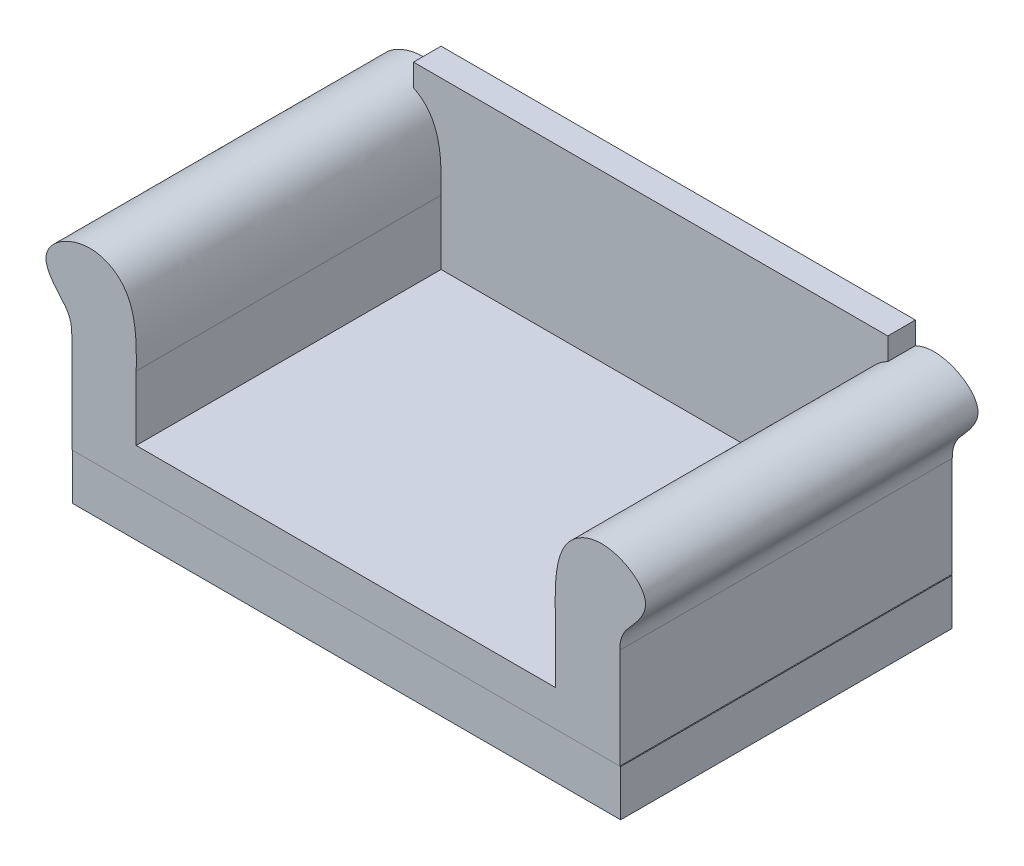
ISO-10303-21;
HEADER;
FILE_DESCRIPTION(('STEP AP214'),'2;1');
FILE_NAME('part.step','',(''),(''),'','','');
FILE_SCHEMA(('AUTOMOTIVE_DESIGN { 1 0 10303 214 1 1 1 1 }'));
ENDSEC;
DATA;
#1=APPLICATION_CONTEXT('core data for automotive mechanical design processes');
#2=APPLICATION_PROTOCOL_DEFINITION('international standard','automotive_design',2000,#1);
#3=PRODUCT_CONTEXT('',#1,'mechanical');
#4=PRODUCT('Part','Part','',(#3));
#5=PRODUCT_RELATED_PRODUCT_CATEGORY('part','',(#4));
#6=PRODUCT_DEFINITION_FORMATION('','',#4);
#7=PRODUCT_DEFINITION_CONTEXT('part definition',#1,'design');
#8=PRODUCT_DEFINITION('design','',#6,#7);
#9=PRODUCT_DEFINITION_SHAPE('','',#8);
#10=(LENGTH_UNIT() NAMED_UNIT(*) SI_UNIT(.MILLI.,.METRE.));
#11=(NAMED_UNIT(*) PLANE_ANGLE_UNIT() SI_UNIT($,.RADIAN.));
#12=(NAMED_UNIT(*) SI_UNIT($,.STERADIAN.) SOLID_ANGLE_UNIT());
#13=UNCERTAINTY_MEASURE_WITH_UNIT(LENGTH_MEASURE(1.E-05),#10,'distance_accuracy_value','');
#14=(GEOMETRIC_REPRESENTATION_CONTEXT(3) GLOBAL_UNCERTAINTY_ASSIGNED_CONTEXT((#13)) GLOBAL_UNIT_ASSIGNED_CONTEXT((#10,
#11,#12)) REPRESENTATION_CONTEXT('',''));
#15=CARTESIAN_POINT('',(0.,0.,0.));
#16=DIRECTION('',(0.,0.,1.));
#17=DIRECTION('',(1.,0.,0.));
#18=AXIS2_PLACEMENT_3D('',#15,#16,#17);
#19=CARTESIAN_POINT('',(755.650000000029,406.4,-2188.44072928543));
#20=CARTESIAN_POINT('',(755.650000000029,451.087278401494,-2188.44072928543));
#21=CARTESIAN_POINT('',(791.216850954464,477.433435735854,-2188.44072928543));
#22=CARTESIAN_POINT('',(855.398910121323,573.852472449306,-2188.44072928543));
#23=CARTESIAN_POINT('',(720.303655557243,663.232501148757,-2188.44072928543));
#24=CARTESIAN_POINT('',(568.867733776214,589.838855635776,-2188.44072928543));
#25=CARTESIAN_POINT('',(577.850000000043,447.650661262856,-2188.44072928543));
#26=CARTESIAN_POINT('',(577.850000000043,406.4,-2188.44072928543));
#27=B_SPLINE_CURVE_WITH_KNOTS('',3,(#19,#20,#21,#22,#23,#24,#25,#26),.UNSPECIFIED.,.F.,.F.,(4,1,
1,1,1,4),(0.,0.157242682819164,0.266642819215483,0.492649096613345,0.701571925078321,1.),.UNSPECIFIED.);
#28=DIRECTION('',(0.,0.,1.));
#29=VECTOR('',#28,1.);
#30=SURFACE_OF_LINEAR_EXTRUSION('',#27,#29);
#31=DIRECTION('',(0.,0.,1.));
#32=VECTOR('',#31,1.);
#33=CARTESIAN_POINT('',(654.05,624.464719554952,1.27000000001143));
#34=LINE('',#33,#32);
#35=CARTESIAN_POINT('',(654.05,624.464719554952,-381.));
#36=VERTEX_POINT('',#35);
#37=CARTESIAN_POINT('',(654.05,624.464719554952,-457.2));
#38=VERTEX_POINT('',#37);
#39=EDGE_CURVE('E12',#36,#38,#34,.F.);
#40=ORIENTED_EDGE('',*,*,#39,.F.);
#41=CARTESIAN_POINT('',(755.650000000029,406.4,-381.));
#42=CARTESIAN_POINT('',(755.650000000029,451.087278401494,-381.));
#43=CARTESIAN_POINT('',(791.216850954464,477.433435735854,-381.));
#44=CARTESIAN_POINT('',(855.398910121323,573.852472449306,-381.));
#45=CARTESIAN_POINT('',(720.303655557243,663.232501148757,-381.));
#46=CARTESIAN_POINT('',(568.867733776214,589.838855635776,-381.));
#47=CARTESIAN_POINT('',(577.850000000043,447.650661262856,-381.));
#48=CARTESIAN_POINT('',(577.850000000043,406.4,-381.));
#49=B_SPLINE_CURVE_WITH_KNOTS('',3,(#41,#42,#43,#44,#45,#46,#47,#48),.UNSPECIFIED.,.F.,.F.,(4,1,
1,1,1,4),(0.,0.157242682819164,0.266642819215483,0.492649096613345,0.701571925078321,1.),.UNSPECIFIED.);
#50=CARTESIAN_POINT('',(577.850000000029,406.4,-381.));
#51=VERTEX_POINT('',#50);
#52=EDGE_CURVE('E137',#36,#51,#49,.T.);
#53=ORIENTED_EDGE('',*,*,#52,.T.);
#54=DIRECTION('',(0.,0.,1.));
#55=VECTOR('',#54,1.);
#56=CARTESIAN_POINT('',(577.850000000029,406.4,-2188.44072928543));
#57=LINE('',#56,#55);
#58=CARTESIAN_POINT('',(577.850000000029,406.4,459.739999999976));
#59=VERTEX_POINT('',#58);
#60=EDGE_CURVE('E148',#51,#59,#57,.T.);
#61=ORIENTED_EDGE('',*,*,#60,.T.);
#62=CARTESIAN_POINT('',(755.650000000029,406.4,459.739999999976));
#63=CARTESIAN_POINT('',(755.650000000029,451.087278401494,459.739999999976));
#64=CARTESIAN_POINT('',(791.216850954464,477.433435735854,459.739999999976));
#65=CARTESIAN_POINT('',(855.398910121323,573.852472449306,459.739999999976));
#66=CARTESIAN_POINT('',(720.303655557243,663.232501148757,459.739999999976));
#67=CARTESIAN_POINT('',(568.867733776214,589.838855635776,459.739999999976));
#68=CARTESIAN_POINT('',(577.850000000043,447.650661262856,459.739999999976));
#69=CARTESIAN_POINT('',(577.850000000043,406.4,459.739999999976));
#70=B_SPLINE_CURVE_WITH_KNOTS('',3,(#62,#63,#64,#65,#66,#67,#68,#69),.UNSPECIFIED.,.F.,.F.,(4,1,
1,1,1,4),(0.,0.157242682819164,0.266642819215483,0.492649096613345,0.701571925078321,1.),.UNSPECIFIED.);
#71=CARTESIAN_POINT('',(755.650000000029,406.4,459.739999999976));
#72=VERTEX_POINT('',#71);
#73=EDGE_CURVE('E128',#72,#59,#70,.T.);
#74=ORIENTED_EDGE('',*,*,#73,.F.);
#75=DIRECTION('',(0.,0.,1.));
#76=VECTOR('',#75,1.);
#77=CARTESIAN_POINT('',(755.650000000029,406.4,-2188.44072928543));
#78=LINE('',#77,#76);
#79=CARTESIAN_POINT('',(755.650000000014,406.4,-457.199999999953));
#80=VERTEX_POINT('',#79);
#81=EDGE_CURVE('E113',#80,#72,#78,.T.);
#82=ORIENTED_EDGE('',*,*,#81,.F.);
#83=CARTESIAN_POINT('',(755.650000000029,406.4,-457.199999999976));
#84=CARTESIAN_POINT('',(755.650000000029,451.087278401494,-457.199999999976));
#85=CARTESIAN_POINT('',(791.216850954464,477.433435735854,-457.199999999976));
#86=CARTESIAN_POINT('',(855.398910121323,573.852472449306,-457.199999999976));
#87=CARTESIAN_POINT('',(720.303655557243,663.232501148757,-457.199999999976));
#88=CARTESIAN_POINT('',(568.867733776214,589.838855635776,-457.199999999976));
#89=CARTESIAN_POINT('',(577.850000000043,447.650661262856,-457.199999999976));
#90=CARTESIAN_POINT('',(577.850000000043,406.4,-457.199999999976));
#91=B_SPLINE_CURVE_WITH_KNOTS('',3,(#83,#84,#85,#86,#87,#88,#89,#90),.UNSPECIFIED.,.F.,.F.,(4,1,
1,1,1,4),(0.,0.157242682819164,0.266642819215483,0.492649096613345,0.701571925078321,1.),.UNSPECIFIED.);
#92=EDGE_CURVE('E104',#80,#38,#91,.T.);
#93=ORIENTED_EDGE('',*,*,#92,.T.);
#94=EDGE_LOOP('',(#40,#53,#61,#74,#82,#93));
#95=FACE_BOUND('',#94,.T.);
#96=ADVANCED_FACE('F53',(#95),#30,.T.);
#97=CARTESIAN_POINT('',(577.850000000029,406.4,-2188.44072928543));
#98=DIRECTION('',(-1.,0.,0.));
#99=DIRECTION('',(0.,0.,1.));
#100=AXIS2_PLACEMENT_3D('',#97,#98,#99);
#101=PLANE('',#100);
#102=ORIENTED_EDGE('',*,*,#60,.F.);
#103=DIRECTION('',(0.,-1.,0.));
#104=VECTOR('',#103,1.);
#105=CARTESIAN_POINT('',(577.850000000029,406.4,-381.));
#106=LINE('',#105,#104);
#107=CARTESIAN_POINT('',(577.850000000029,228.6,-381.));
#108=VERTEX_POINT('',#107);
#109=EDGE_CURVE('E259',#51,#108,#106,.T.);
#110=ORIENTED_EDGE('',*,*,#109,.T.);
#111=DIRECTION('',(0.,0.,1.));
#112=VECTOR('',#111,1.);
#113=CARTESIAN_POINT('',(577.850000000029,228.6,-2188.44072928543));
#114=LINE('',#113,#112);
#115=CARTESIAN_POINT('',(577.850000000029,228.6,459.739999999976));
#116=VERTEX_POINT('',#115);
#117=EDGE_CURVE('E162',#108,#116,#114,.T.);
#118=ORIENTED_EDGE('',*,*,#117,.T.);
#119=DIRECTION('',(0.,-1.,0.));
#120=VECTOR('',#119,1.);
#121=CARTESIAN_POINT('',(577.850000000029,406.4,459.739999999976));
#122=LINE('',#121,#120);
#123=EDGE_CURVE('E125',#59,#116,#122,.T.);
#124=ORIENTED_EDGE('',*,*,#123,.F.);
#125=EDGE_LOOP('',(#102,#110,#118,#124));
#126=FACE_BOUND('',#125,.T.);
#127=ADVANCED_FACE('F193',(#126),#101,.T.);
#128=CARTESIAN_POINT('',(-577.85,228.6,-2188.44072928543));
#129=DIRECTION('',(0.,-1.,0.));
#130=DIRECTION('',(0.,0.,-1.));
#131=AXIS2_PLACEMENT_3D('',#128,#129,#130);
#132=PLANE('',#131);
#133=DIRECTION('',(1.,0.,0.));
#134=VECTOR('',#133,1.);
#135=CARTESIAN_POINT('',(-654.05,228.6,-381.));
#136=LINE('',#135,#134);
#137=CARTESIAN_POINT('',(-577.85,228.6,-381.));
#138=VERTEX_POINT('',#137);
#139=EDGE_CURVE('E246',#138,#108,#136,.T.);
#140=ORIENTED_EDGE('',*,*,#139,.F.);
#141=DIRECTION('',(0.,0.,1.));
#142=VECTOR('',#141,1.);
#143=CARTESIAN_POINT('',(-577.85,228.6,-2188.44072928543));
#144=LINE('',#143,#142);
#145=CARTESIAN_POINT('',(-577.85,228.6,459.739999999976));
#146=VERTEX_POINT('',#145);
#147=EDGE_CURVE('E160',#138,#146,#144,.T.);
#148=ORIENTED_EDGE('',*,*,#147,.T.);
#149=DIRECTION('',(1.,0.,0.));
#150=VECTOR('',#149,1.);
#151=CARTESIAN_POINT('',(-577.85,228.6,459.739999999976));
#152=LINE('',#151,#150);
#153=EDGE_CURVE('E159',#146,#116,#152,.T.);
#154=ORIENTED_EDGE('',*,*,#153,.T.);
#155=ORIENTED_EDGE('',*,*,#117,.F.);
#156=EDGE_LOOP('',(#140,#148,#154,#155));
#157=FACE_BOUND('',#156,.T.);
#158=ADVANCED_FACE('F189',(#157),#132,.F.);
#159=CARTESIAN_POINT('',(-577.85,406.4,-2188.44072928543));
#160=DIRECTION('',(-1.,0.,0.));
#161=DIRECTION('',(0.,0.,1.));
#162=AXIS2_PLACEMENT_3D('',#159,#160,#161);
#163=PLANE('',#162);
#164=DIRECTION('',(0.,-1.,0.));
#165=VECTOR('',#164,1.);
#166=CARTESIAN_POINT('',(-577.85,406.4,-381.));
#167=LINE('',#166,#165);
#168=CARTESIAN_POINT('',(-577.850000000014,406.4,-381.));
#169=VERTEX_POINT('',#168);
#170=EDGE_CURVE('E255',#169,#138,#167,.T.);
#171=ORIENTED_EDGE('',*,*,#170,.F.);
#172=DIRECTION('',(0.,0.,1.));
#173=VECTOR('',#172,1.);
#174=CARTESIAN_POINT('',(-577.850000000014,406.4,-2188.44072928543));
#175=LINE('',#174,#173);
#176=CARTESIAN_POINT('',(-577.850000000014,406.4,459.739999999976));
#177=VERTEX_POINT('',#176);
#178=EDGE_CURVE('E157',#169,#177,#175,.T.);
#179=ORIENTED_EDGE('',*,*,#178,.T.);
#180=DIRECTION('',(0.,-1.,0.));
#181=VECTOR('',#180,1.);
#182=CARTESIAN_POINT('',(-577.85,406.4,459.739999999976));
#183=LINE('',#182,#181);
#184=EDGE_CURVE('E156',#177,#146,#183,.T.);
#185=ORIENTED_EDGE('',*,*,#184,.T.);
#186=ORIENTED_EDGE('',*,*,#147,.F.);
#187=EDGE_LOOP('',(#171,#179,#185,#186));
#188=FACE_BOUND('',#187,.T.);
#189=ADVANCED_FACE('F183',(#188),#163,.F.);
#190=CARTESIAN_POINT('',(-755.65,406.4,-2188.44072928543));
#191=CARTESIAN_POINT('',(-755.65,451.087278401494,-2188.44072928543));
#192=CARTESIAN_POINT('',(-791.216850954435,477.433435735854,-2188.44072928543));
#193=CARTESIAN_POINT('',(-855.398910121294,573.852472449306,-2188.44072928543));
#194=CARTESIAN_POINT('',(-720.303655557214,663.232501148757,-2188.44072928543));
#195=CARTESIAN_POINT('',(-568.867733776185,589.838855635776,-2188.44072928543));
#196=CARTESIAN_POINT('',(-577.850000000014,447.650661262856,-2188.44072928543));
#197=CARTESIAN_POINT('',(-577.850000000014,406.4,-2188.44072928543));
#198=B_SPLINE_CURVE_WITH_KNOTS('',3,(#190,#191,#192,#193,#194,#195,#196,#197),.UNSPECIFIED.,.F.,
.F.,(4,1,1,1,1,4),(0.,0.157242682819164,0.266642819215483,0.492649096613345,0.701571925078321,
1.),.UNSPECIFIED.);
#199=DIRECTION('',(0.,0.,1.));
#200=VECTOR('',#199,1.);
#201=SURFACE_OF_LINEAR_EXTRUSION('',#198,#200);
#202=DIRECTION('',(0.,0.,1.));
#203=VECTOR('',#202,1.);
#204=CARTESIAN_POINT('',(-654.049999999999,624.464719554965,1.269999999991));
#205=LINE('',#204,#203);
#206=CARTESIAN_POINT('',(-654.05,624.464719554966,-457.2));
#207=VERTEX_POINT('',#206);
#208=CARTESIAN_POINT('',(-654.05,624.464719554966,-381.));
#209=VERTEX_POINT('',#208);
#210=EDGE_CURVE('E62',#207,#209,#205,.T.);
#211=ORIENTED_EDGE('',*,*,#210,.F.);
#212=CARTESIAN_POINT('',(-755.65,406.4,-457.199999999976));
#213=CARTESIAN_POINT('',(-755.65,451.087278401494,-457.199999999976));
#214=CARTESIAN_POINT('',(-791.216850954435,477.433435735854,-457.199999999976));
#215=CARTESIAN_POINT('',(-855.398910121294,573.852472449306,-457.199999999976));
#216=CARTESIAN_POINT('',(-720.303655557214,663.232501148757,-457.199999999976));
#217=CARTESIAN_POINT('',(-568.867733776185,589.838855635776,-457.199999999976));
#218=CARTESIAN_POINT('',(-577.850000000014,447.650661262856,-457.199999999976));
#219=CARTESIAN_POINT('',(-577.850000000014,406.4,-457.199999999976));
#220=B_SPLINE_CURVE_WITH_KNOTS('',3,(#212,#213,#214,#215,#216,#217,#218,#219),.UNSPECIFIED.,.F.,
.F.,(4,1,1,1,1,4),(0.,0.157242682819164,0.266642819215483,0.492649096613345,0.701571925078321,
1.),.UNSPECIFIED.);
#221=CARTESIAN_POINT('',(-755.65,406.4,-457.199999999976));
#222=VERTEX_POINT('',#221);
#223=EDGE_CURVE('E136',#222,#207,#220,.T.);
#224=ORIENTED_EDGE('',*,*,#223,.F.);
#225=DIRECTION('',(0.,0.,1.));
#226=VECTOR('',#225,1.);
#227=CARTESIAN_POINT('',(-755.65,406.4,-2188.44072928543));
#228=LINE('',#227,#226);
#229=CARTESIAN_POINT('',(-755.65,406.4,459.739999999976));
#230=VERTEX_POINT('',#229);
#231=EDGE_CURVE('E153',#222,#230,#228,.T.);
#232=ORIENTED_EDGE('',*,*,#231,.T.);
#233=CARTESIAN_POINT('',(-755.65,406.4,459.739999999976));
#234=CARTESIAN_POINT('',(-755.65,451.087278401494,459.739999999976));
#235=CARTESIAN_POINT('',(-791.216850954435,477.433435735854,459.739999999976));
#236=CARTESIAN_POINT('',(-855.398910121294,573.852472449306,459.739999999976));
#237=CARTESIAN_POINT('',(-720.303655557214,663.232501148757,459.739999999976));
#238=CARTESIAN_POINT('',(-568.867733776185,589.838855635776,459.739999999976));
#239=CARTESIAN_POINT('',(-577.850000000014,447.650661262856,459.739999999976));
#240=CARTESIAN_POINT('',(-577.850000000014,406.4,459.739999999976));
#241=B_SPLINE_CURVE_WITH_KNOTS('',3,(#233,#234,#235,#236,#237,#238,#239,#240),.UNSPECIFIED.,.F.,
.F.,(4,1,1,1,1,4),(0.,0.157242682819164,0.266642819215483,0.492649096613345,0.701571925078321,
1.),.UNSPECIFIED.);
#242=EDGE_CURVE('E155',#230,#177,#241,.T.);
#243=ORIENTED_EDGE('',*,*,#242,.T.);
#244=ORIENTED_EDGE('',*,*,#178,.F.);
#245=CARTESIAN_POINT('',(-755.65,406.4,-381.));
#246=CARTESIAN_POINT('',(-755.65,451.087278401494,-381.));
#247=CARTESIAN_POINT('',(-791.216850954435,477.433435735854,-381.));
#248=CARTESIAN_POINT('',(-855.398910121294,573.852472449306,-381.));
#249=CARTESIAN_POINT('',(-720.303655557214,663.232501148757,-381.));
#250=CARTESIAN_POINT('',(-568.867733776185,589.838855635776,-381.));
#251=CARTESIAN_POINT('',(-577.850000000014,447.650661262856,-381.));
#252=CARTESIAN_POINT('',(-577.850000000014,406.4,-381.));
#253=B_SPLINE_CURVE_WITH_KNOTS('',3,(#245,#246,#247,#248,#249,#250,#251,#252),.UNSPECIFIED.,.F.,
.F.,(4,1,1,1,1,4),(0.,0.157242682819164,0.266642819215483,0.492649096613345,0.701571925078321,
1.),.UNSPECIFIED.);
#254=EDGE_CURVE('E310',#209,#169,#253,.T.);
#255=ORIENTED_EDGE('',*,*,#254,.F.);
#256=EDGE_LOOP('',(#211,#224,#232,#243,#244,#255));
#257=FACE_BOUND('',#256,.T.);
#258=ADVANCED_FACE('F179',(#257),#201,.F.);
#259=CARTESIAN_POINT('',(1.42742960308941E-11,127.,-457.199999999976));
#260=DIRECTION('',(0.,0.,-1.));
#261=DIRECTION('',(-1.,0.,0.));
#262=AXIS2_PLACEMENT_3D('',#259,#260,#261);
#263=PLANE('',#262);
#264=DIRECTION('',(0.,-1.,0.));
#265=VECTOR('',#264,1.);
#266=CARTESIAN_POINT('',(654.05,685.8,-457.2));
#267=LINE('',#266,#265);
#268=CARTESIAN_POINT('',(654.05,685.8,-457.2));
#269=VERTEX_POINT('',#268);
#270=EDGE_CURVE('E262',#269,#38,#267,.T.);
#271=ORIENTED_EDGE('',*,*,#270,.T.);
#272=ORIENTED_EDGE('',*,*,#92,.F.);
#273=DIRECTION('',(0.,1.,0.));
#274=VECTOR('',#273,1.);
#275=CARTESIAN_POINT('',(755.650000000014,129.54,-457.199999999953));
#276=LINE('',#275,#274);
#277=CARTESIAN_POINT('',(755.650000000014,129.54,-457.199999999976));
#278=VERTEX_POINT('',#277);
#279=EDGE_CURVE('E108',#278,#80,#276,.T.);
#280=ORIENTED_EDGE('',*,*,#279,.F.);
#281=DIRECTION('',(1.,0.,0.));
#282=VECTOR('',#281,1.);
#283=CARTESIAN_POINT('',(-755.650000000039,129.54,-457.2));
#284=LINE('',#283,#282);
#285=CARTESIAN_POINT('',(-755.649999999986,129.54,-457.2));
#286=VERTEX_POINT('',#285);
#287=EDGE_CURVE('E111',#286,#278,#284,.T.);
#288=ORIENTED_EDGE('',*,*,#287,.F.);
#289=DIRECTION('',(0.,1.,0.));
#290=VECTOR('',#289,1.);
#291=CARTESIAN_POINT('',(-755.649999999986,129.54,-457.2));
#292=LINE('',#291,#290);
#293=EDGE_CURVE('E134',#286,#222,#292,.T.);
#294=ORIENTED_EDGE('',*,*,#293,.T.);
#295=ORIENTED_EDGE('',*,*,#223,.T.);
#296=DIRECTION('',(0.,-1.,0.));
#297=VECTOR('',#296,1.);
#298=CARTESIAN_POINT('',(-654.05,685.8,-457.2));
#299=LINE('',#298,#297);
#300=CARTESIAN_POINT('',(-654.05,685.8,-457.2));
#301=VERTEX_POINT('',#300);
#302=EDGE_CURVE('E318',#301,#207,#299,.T.);
#303=ORIENTED_EDGE('',*,*,#302,.F.);
#304=DIRECTION('',(1.,0.,0.));
#305=VECTOR('',#304,1.);
#306=CARTESIAN_POINT('',(-654.05,685.8,-457.2));
#307=LINE('',#306,#305);
#308=EDGE_CURVE('E243',#301,#269,#307,.T.);
#309=ORIENTED_EDGE('',*,*,#308,.T.);
#310=EDGE_LOOP('',(#271,#272,#280,#288,#294,#295,#303,#309));
#311=FACE_BOUND('',#310,.T.);
#312=ADVANCED_FACE('F55',(#311),#263,.T.);
#313=CARTESIAN_POINT('',(-715.980650784061,635.494561155671,459.739999999976));
#314=DIRECTION('',(0.,0.,-1.));
#315=DIRECTION('',(-1.,0.,0.));
#316=AXIS2_PLACEMENT_3D('',#313,#314,#315);
#317=PLANE('',#316);
#318=DIRECTION('',(0.,1.,0.));
#319=VECTOR('',#318,1.);
#320=CARTESIAN_POINT('',(-755.649999999986,129.54,459.739999999976));
#321=LINE('',#320,#319);
#322=CARTESIAN_POINT('',(-755.649999999986,129.54,459.739999999976));
#323=VERTEX_POINT('',#322);
#324=EDGE_CURVE('E132',#323,#230,#321,.T.);
#325=ORIENTED_EDGE('',*,*,#324,.F.);
#326=DIRECTION('',(1.,0.,0.));
#327=VECTOR('',#326,1.);
#328=CARTESIAN_POINT('',(-755.649999999986,129.54,459.739999999976));
#329=LINE('',#328,#327);
#330=CARTESIAN_POINT('',(755.650000000014,129.54,459.739999999976));
#331=VERTEX_POINT('',#330);
#332=EDGE_CURVE('E142',#323,#331,#329,.T.);
#333=ORIENTED_EDGE('',*,*,#332,.T.);
#334=DIRECTION('',(0.,1.,0.));
#335=VECTOR('',#334,1.);
#336=CARTESIAN_POINT('',(755.650000000014,129.54,459.739999999976));
#337=LINE('',#336,#335);
#338=EDGE_CURVE('E119',#331,#72,#337,.T.);
#339=ORIENTED_EDGE('',*,*,#338,.T.);
#340=ORIENTED_EDGE('',*,*,#73,.T.);
#341=ORIENTED_EDGE('',*,*,#123,.T.);
#342=ORIENTED_EDGE('',*,*,#153,.F.);
#343=ORIENTED_EDGE('',*,*,#184,.F.);
#344=ORIENTED_EDGE('',*,*,#242,.F.);
#345=EDGE_LOOP('',(#325,#333,#339,#340,#341,#342,#343,#344));
#346=FACE_BOUND('',#345,.T.);
#347=ADVANCED_FACE('F203',(#346),#317,.F.);
#348=CARTESIAN_POINT('',(-755.649999999986,129.54,-2188.44072928543));
#349=DIRECTION('',(0.,-1.,0.));
#350=DIRECTION('',(0.,0.,-1.));
#351=AXIS2_PLACEMENT_3D('',#348,#349,#350);
#352=PLANE('',#351);
#353=DIRECTION('',(0.,0.,1.));
#354=VECTOR('',#353,1.);
#355=CARTESIAN_POINT('',(-755.649999999986,129.54,-2188.44072928543));
#356=LINE('',#355,#354);
#357=EDGE_CURVE('E70',#286,#323,#356,.T.);
#358=ORIENTED_EDGE('',*,*,#357,.F.);
#359=ORIENTED_EDGE('',*,*,#287,.T.);
#360=DIRECTION('',(0.,0.,1.));
#361=VECTOR('',#360,1.);
#362=CARTESIAN_POINT('',(755.650000000014,129.54,-2188.44072928543));
#363=LINE('',#362,#361);
#364=EDGE_CURVE('E114',#278,#331,#363,.T.);
#365=ORIENTED_EDGE('',*,*,#364,.T.);
#366=ORIENTED_EDGE('',*,*,#332,.F.);
#367=EDGE_LOOP('',(#358,#359,#365,#366));
#368=FACE_BOUND('',#367,.T.);
#369=ADVANCED_FACE('F124',(#368),#352,.T.);
#370=CARTESIAN_POINT('',(755.650000000014,129.54,-2188.44072928543));
#371=DIRECTION('',(1.,0.,0.));
#372=DIRECTION('',(0.,0.,-1.));
#373=AXIS2_PLACEMENT_3D('',#370,#371,#372);
#374=PLANE('',#373);
#375=ORIENTED_EDGE('',*,*,#364,.F.);
#376=ORIENTED_EDGE('',*,*,#279,.T.);
#377=ORIENTED_EDGE('',*,*,#81,.T.);
#378=ORIENTED_EDGE('',*,*,#338,.F.);
#379=EDGE_LOOP('',(#375,#376,#377,#378));
#380=FACE_BOUND('',#379,.T.);
#381=ADVANCED_FACE('F117',(#380),#374,.T.);
#382=CARTESIAN_POINT('',(-755.649999999986,129.54,-2188.44072928543));
#383=DIRECTION('',(1.,0.,0.));
#384=DIRECTION('',(0.,0.,-1.));
#385=AXIS2_PLACEMENT_3D('',#382,#383,#384);
#386=PLANE('',#385);
#387=ORIENTED_EDGE('',*,*,#293,.F.);
#388=ORIENTED_EDGE('',*,*,#357,.T.);
#389=ORIENTED_EDGE('',*,*,#324,.T.);
#390=ORIENTED_EDGE('',*,*,#231,.F.);
#391=EDGE_LOOP('',(#387,#388,#389,#390));
#392=FACE_BOUND('',#391,.T.);
#393=ADVANCED_FACE('F185',(#392),#386,.F.);
#394=CARTESIAN_POINT('',(-654.05,685.8,-457.2));
#395=DIRECTION('',(1.,0.,0.));
#396=DIRECTION('',(0.,0.,-1.));
#397=AXIS2_PLACEMENT_3D('',#394,#395,#396);
#398=PLANE('',#397);
#399=ORIENTED_EDGE('',*,*,#302,.T.);
#400=ORIENTED_EDGE('',*,*,#210,.T.);
#401=DIRECTION('',(0.,-1.,0.));
#402=VECTOR('',#401,1.);
#403=CARTESIAN_POINT('',(-654.05,685.8,-381.));
#404=LINE('',#403,#402);
#405=CARTESIAN_POINT('',(-654.05,685.8,-381.));
#406=VERTEX_POINT('',#405);
#407=EDGE_CURVE('E250',#406,#209,#404,.T.);
#408=ORIENTED_EDGE('',*,*,#407,.F.);
#409=DIRECTION('',(0.,0.,1.));
#410=VECTOR('',#409,1.);
#411=CARTESIAN_POINT('',(-654.05,685.8,-457.2));
#412=LINE('',#411,#410);
#413=EDGE_CURVE('E234',#301,#406,#412,.T.);
#414=ORIENTED_EDGE('',*,*,#413,.F.);
#415=EDGE_LOOP('',(#399,#400,#408,#414));
#416=FACE_BOUND('',#415,.T.);
#417=ADVANCED_FACE('F212',(#416),#398,.F.);
#418=CARTESIAN_POINT('',(-654.05,685.8,-381.));
#419=DIRECTION('',(0.,0.,-1.));
#420=DIRECTION('',(-1.,0.,0.));
#421=AXIS2_PLACEMENT_3D('',#418,#419,#420);
#422=PLANE('',#421);
#423=ORIENTED_EDGE('',*,*,#52,.F.);
#424=DIRECTION('',(0.,-1.,0.));
#425=VECTOR('',#424,1.);
#426=CARTESIAN_POINT('',(654.05,685.8,-381.));
#427=LINE('',#426,#425);
#428=CARTESIAN_POINT('',(654.05,685.8,-381.));
#429=VERTEX_POINT('',#428);
#430=EDGE_CURVE('E256',#429,#36,#427,.T.);
#431=ORIENTED_EDGE('',*,*,#430,.F.);
#432=DIRECTION('',(1.,0.,0.));
#433=VECTOR('',#432,1.);
#434=CARTESIAN_POINT('',(-654.05,685.8,-381.));
#435=LINE('',#434,#433);
#436=EDGE_CURVE('E239',#406,#429,#435,.T.);
#437=ORIENTED_EDGE('',*,*,#436,.F.);
#438=ORIENTED_EDGE('',*,*,#407,.T.);
#439=ORIENTED_EDGE('',*,*,#254,.T.);
#440=ORIENTED_EDGE('',*,*,#170,.T.);
#441=ORIENTED_EDGE('',*,*,#139,.T.);
#442=ORIENTED_EDGE('',*,*,#109,.F.);
#443=EDGE_LOOP('',(#423,#431,#437,#438,#439,#440,#441,#442));
#444=FACE_BOUND('',#443,.T.);
#445=ADVANCED_FACE('F215',(#444),#422,.F.);
#446=CARTESIAN_POINT('',(654.05,685.8,-457.2));
#447=DIRECTION('',(1.,0.,0.));
#448=DIRECTION('',(0.,0.,-1.));
#449=AXIS2_PLACEMENT_3D('',#446,#447,#448);
#450=PLANE('',#449);
#451=ORIENTED_EDGE('',*,*,#430,.T.);
#452=ORIENTED_EDGE('',*,*,#39,.T.);
#453=ORIENTED_EDGE('',*,*,#270,.F.);
#454=DIRECTION('',(0.,0.,1.));
#455=VECTOR('',#454,1.);
#456=CARTESIAN_POINT('',(654.05,685.8,-457.2));
#457=LINE('',#456,#455);
#458=EDGE_CURVE('E341',#269,#429,#457,.T.);
#459=ORIENTED_EDGE('',*,*,#458,.T.);
#460=EDGE_LOOP('',(#451,#452,#453,#459));
#461=FACE_BOUND('',#460,.T.);
#462=ADVANCED_FACE('F219',(#461),#450,.T.);
#463=CARTESIAN_POINT('',(0.,685.8,0.));
#464=DIRECTION('',(0.,1.,0.));
#465=DIRECTION('',(0.,0.,1.));
#466=AXIS2_PLACEMENT_3D('',#463,#464,#465);
#467=PLANE('',#466);
#468=ORIENTED_EDGE('',*,*,#413,.T.);
#469=ORIENTED_EDGE('',*,*,#436,.T.);
#470=ORIENTED_EDGE('',*,*,#458,.F.);
#471=ORIENTED_EDGE('',*,*,#308,.F.);
#472=EDGE_LOOP('',(#468,#469,#470,#471));
#473=FACE_BOUND('',#472,.T.);
#474=ADVANCED_FACE('F223',(#473),#467,.T.);
#475=CLOSED_SHELL('',(#96,#127,#158,#189,#258,#312,#347,#369,#381,#393,#417,#445,#462,#474));
#476=MANIFOLD_SOLID_BREP('B2',#475);
#477=CARTESIAN_POINT('',(-666.75,127.,0.));
#478=DIRECTION('',(1.,0.,0.));
#479=DIRECTION('',(0.,0.,-1.));
#480=AXIS2_PLACEMENT_3D('',#477,#478,#479);
#481=PLANE('',#480);
#482=DIRECTION('',(0.,0.,1.));
#483=VECTOR('',#482,1.);
#484=CARTESIAN_POINT('',(-666.75,0.,0.));
#485=LINE('',#484,#483);
#486=CARTESIAN_POINT('',(-666.75,0.,-431.800000000003));
#487=VERTEX_POINT('',#486);
#488=CARTESIAN_POINT('',(-666.75,0.,431.800000000003));
#489=VERTEX_POINT('',#488);
#490=EDGE_CURVE('E604',#487,#489,#485,.T.);
#491=ORIENTED_EDGE('',*,*,#490,.F.);
#492=DIRECTION('',(0.,-1.,0.));
#493=VECTOR('',#492,1.);
#494=CARTESIAN_POINT('',(-666.75,127.,-431.800000000003));
#495=LINE('',#494,#493);
#496=CARTESIAN_POINT('',(-666.75,127.,-431.800000000003));
#497=VERTEX_POINT('',#496);
#498=EDGE_CURVE('E51',#497,#487,#495,.T.);
#499=ORIENTED_EDGE('',*,*,#498,.F.);
#500=DIRECTION('',(0.,0.,1.));
#501=VECTOR('',#500,1.);
#502=CARTESIAN_POINT('',(-666.75,127.,0.));
#503=LINE('',#502,#501);
#504=CARTESIAN_POINT('',(-666.75,127.,431.800000000003));
#505=VERTEX_POINT('',#504);
#506=EDGE_CURVE('E541',#497,#505,#503,.T.);
#507=ORIENTED_EDGE('',*,*,#506,.T.);
#508=DIRECTION('',(0.,-1.,0.));
#509=VECTOR('',#508,1.);
#510=CARTESIAN_POINT('',(-666.75,127.,431.800000000003));
#511=LINE('',#510,#509);
#512=EDGE_CURVE('E451',#505,#489,#511,.T.);
#513=ORIENTED_EDGE('',*,*,#512,.T.);
#514=EDGE_LOOP('',(#491,#499,#507,#513));
#515=FACE_BOUND('',#514,.T.);
#516=ADVANCED_FACE('F432',(#515),#481,.T.);
#517=CARTESIAN_POINT('',(0.,127.,-431.800000000003));
#518=DIRECTION('',(0.,0.,-1.));
#519=DIRECTION('',(-1.,0.,0.));
#520=AXIS2_PLACEMENT_3D('',#517,#518,#519);
#521=PLANE('',#520);
#522=DIRECTION('',(1.,0.,0.));
#523=VECTOR('',#522,1.);
#524=CARTESIAN_POINT('',(0.,0.,-431.800000000003));
#525=LINE('',#524,#523);
#526=CARTESIAN_POINT('',(31.7499999999999,0.,-431.800000000003));
#527=VERTEX_POINT('',#526);
#528=EDGE_CURVE('E547',#487,#527,#525,.T.);
#529=ORIENTED_EDGE('',*,*,#528,.T.);
#530=DIRECTION('',(0.,-1.,0.));
#531=VECTOR('',#530,1.);
#532=CARTESIAN_POINT('',(31.7499999999999,127.,-431.800000000003));
#533=LINE('',#532,#531);
#534=CARTESIAN_POINT('',(31.7499999999999,127.,-431.800000000003));
#535=VERTEX_POINT('',#534);
#536=EDGE_CURVE('E442',#535,#527,#533,.T.);
#537=ORIENTED_EDGE('',*,*,#536,.F.);
#538=DIRECTION('',(1.,0.,0.));
#539=VECTOR('',#538,1.);
#540=CARTESIAN_POINT('',(0.,127.,-431.800000000003));
#541=LINE('',#540,#539);
#542=EDGE_CURVE('E536',#497,#535,#541,.T.);
#543=ORIENTED_EDGE('',*,*,#542,.F.);
#544=ORIENTED_EDGE('',*,*,#498,.T.);
#545=EDGE_LOOP('',(#529,#537,#543,#544));
#546=FACE_BOUND('',#545,.T.);
#547=ADVANCED_FACE('F545',(#546),#521,.F.);
#548=CARTESIAN_POINT('',(31.7499999999999,127.,0.));
#549=DIRECTION('',(1.,0.,0.));
#550=DIRECTION('',(0.,0.,-1.));
#551=AXIS2_PLACEMENT_3D('',#548,#549,#550);
#552=PLANE('',#551);
#553=DIRECTION('',(0.,0.,1.));
#554=VECTOR('',#553,1.);
#555=CARTESIAN_POINT('',(31.7499999999999,0.,0.));
#556=LINE('',#555,#554);
#557=CARTESIAN_POINT('',(31.7499999999999,0.,431.800000000003));
#558=VERTEX_POINT('',#557);
#559=EDGE_CURVE('E606',#527,#558,#556,.T.);
#560=ORIENTED_EDGE('',*,*,#559,.T.);
#561=DIRECTION('',(0.,-1.,0.));
#562=VECTOR('',#561,1.);
#563=CARTESIAN_POINT('',(31.7499999999999,127.,431.800000000003));
#564=LINE('',#563,#562);
#565=CARTESIAN_POINT('',(31.7499999999999,127.,431.800000000003));
#566=VERTEX_POINT('',#565);
#567=EDGE_CURVE('E489',#566,#558,#564,.T.);
#568=ORIENTED_EDGE('',*,*,#567,.F.);
#569=DIRECTION('',(0.,0.,1.));
#570=VECTOR('',#569,1.);
#571=CARTESIAN_POINT('',(31.7499999999999,127.,0.));
#572=LINE('',#571,#570);
#573=EDGE_CURVE('E528',#535,#566,#572,.T.);
#574=ORIENTED_EDGE('',*,*,#573,.F.);
#575=ORIENTED_EDGE('',*,*,#536,.T.);
#576=EDGE_LOOP('',(#560,#568,#574,#575));
#577=FACE_BOUND('',#576,.T.);
#578=ADVANCED_FACE('F530',(#577),#552,.F.);
#579=CARTESIAN_POINT('',(1.42742960308941E-11,127.,457.199999999976));
#580=DIRECTION('',(0.,0.,-1.));
#581=DIRECTION('',(-1.,0.,0.));
#582=AXIS2_PLACEMENT_3D('',#579,#580,#581);
#583=PLANE('',#582);
#584=DIRECTION('',(1.,0.,0.));
#585=VECTOR('',#584,1.);
#586=CARTESIAN_POINT('',(1.42742960308941E-11,0.,457.199999999976));
#587=LINE('',#586,#585);
#588=CARTESIAN_POINT('',(-755.65,0.,457.2));
#589=VERTEX_POINT('',#588);
#590=CARTESIAN_POINT('',(755.65,0.,457.2));
#591=VERTEX_POINT('',#590);
#592=EDGE_CURVE('E593',#589,#591,#587,.T.);
#593=ORIENTED_EDGE('',*,*,#592,.T.);
#594=DIRECTION('',(0.,-1.,0.));
#595=VECTOR('',#594,1.);
#596=CARTESIAN_POINT('',(755.65,127.,457.2));
#597=LINE('',#596,#595);
#598=CARTESIAN_POINT('',(755.65,127.,457.2));
#599=VERTEX_POINT('',#598);
#600=EDGE_CURVE('E559',#599,#591,#597,.T.);
#601=ORIENTED_EDGE('',*,*,#600,.F.);
#602=DIRECTION('',(1.,0.,0.));
#603=VECTOR('',#602,1.);
#604=CARTESIAN_POINT('',(1.42742960308941E-11,127.,457.199999999976));
#605=LINE('',#604,#603);
#606=CARTESIAN_POINT('',(-755.65,127.,457.2));
#607=VERTEX_POINT('',#606);
#608=EDGE_CURVE('E666',#607,#599,#605,.T.);
#609=ORIENTED_EDGE('',*,*,#608,.F.);
#610=DIRECTION('',(0.,-1.,0.));
#611=VECTOR('',#610,1.);
#612=CARTESIAN_POINT('',(-755.65,127.,457.2));
#613=LINE('',#612,#611);
#614=EDGE_CURVE('E552',#607,#589,#613,.T.);
#615=ORIENTED_EDGE('',*,*,#614,.T.);
#616=EDGE_LOOP('',(#593,#601,#609,#615));
#617=FACE_BOUND('',#616,.T.);
#618=ADVANCED_FACE('F645',(#617),#583,.F.);
#619=CARTESIAN_POINT('',(755.65,127.,0.));
#620=DIRECTION('',(1.,0.,0.));
#621=DIRECTION('',(0.,0.,-1.));
#622=AXIS2_PLACEMENT_3D('',#619,#620,#621);
#623=PLANE('',#622);
#624=DIRECTION('',(0.,0.,1.));
#625=VECTOR('',#624,1.);
#626=CARTESIAN_POINT('',(755.65,0.,0.));
#627=LINE('',#626,#625);
#628=CARTESIAN_POINT('',(755.65,0.,-457.2));
#629=VERTEX_POINT('',#628);
#630=EDGE_CURVE('E596',#629,#591,#627,.T.);
#631=ORIENTED_EDGE('',*,*,#630,.F.);
#632=DIRECTION('',(0.,-1.,0.));
#633=VECTOR('',#632,1.);
#634=CARTESIAN_POINT('',(755.65,127.,-457.2));
#635=LINE('',#634,#633);
#636=CARTESIAN_POINT('',(755.65,127.,-457.2));
#637=VERTEX_POINT('',#636);
#638=EDGE_CURVE('E557',#637,#629,#635,.T.);
#639=ORIENTED_EDGE('',*,*,#638,.F.);
#640=DIRECTION('',(0.,0.,1.));
#641=VECTOR('',#640,1.);
#642=CARTESIAN_POINT('',(755.65,127.,0.));
#643=LINE('',#642,#641);
#644=EDGE_CURVE('E661',#637,#599,#643,.T.);
#645=ORIENTED_EDGE('',*,*,#644,.T.);
#646=ORIENTED_EDGE('',*,*,#600,.T.);
#647=EDGE_LOOP('',(#631,#639,#645,#646));
#648=FACE_BOUND('',#647,.T.);
#649=ADVANCED_FACE('F641',(#648),#623,.T.);
#650=CARTESIAN_POINT('',(1.42742960308941E-11,127.,-457.199999999976));
#651=DIRECTION('',(0.,0.,-1.));
#652=DIRECTION('',(-1.,0.,0.));
#653=AXIS2_PLACEMENT_3D('',#650,#651,#652);
#654=PLANE('',#653);
#655=DIRECTION('',(1.,0.,0.));
#656=VECTOR('',#655,1.);
#657=CARTESIAN_POINT('',(1.42742960308941E-11,0.,-457.199999999976));
#658=LINE('',#657,#656);
#659=CARTESIAN_POINT('',(-755.65,0.,-457.2));
#660=VERTEX_POINT('',#659);
#661=EDGE_CURVE('E599',#660,#629,#658,.T.);
#662=ORIENTED_EDGE('',*,*,#661,.F.);
#663=DIRECTION('',(0.,-1.,0.));
#664=VECTOR('',#663,1.);
#665=CARTESIAN_POINT('',(-755.65,127.,-457.2));
#666=LINE('',#665,#664);
#667=CARTESIAN_POINT('',(-755.65,127.,-457.2));
#668=VERTEX_POINT('',#667);
#669=EDGE_CURVE('E555',#668,#660,#666,.T.);
#670=ORIENTED_EDGE('',*,*,#669,.F.);
#671=DIRECTION('',(1.,0.,0.));
#672=VECTOR('',#671,1.);
#673=CARTESIAN_POINT('',(1.42742960308941E-11,127.,-457.199999999976));
#674=LINE('',#673,#672);
#675=EDGE_CURVE('E665',#668,#637,#674,.T.);
#676=ORIENTED_EDGE('',*,*,#675,.T.);
#677=ORIENTED_EDGE('',*,*,#638,.T.);
#678=EDGE_LOOP('',(#662,#670,#676,#677));
#679=FACE_BOUND('',#678,.T.);
#680=ADVANCED_FACE('F627',(#679),#654,.T.);
#681=CARTESIAN_POINT('',(0.,127.,431.800000000003));
#682=DIRECTION('',(0.,0.,-1.));
#683=DIRECTION('',(-1.,0.,0.));
#684=AXIS2_PLACEMENT_3D('',#681,#682,#683);
#685=PLANE('',#684);
#686=DIRECTION('',(1.,0.,0.));
#687=VECTOR('',#686,1.);
#688=CARTESIAN_POINT('',(0.,0.,431.800000000003));
#689=LINE('',#688,#687);
#690=CARTESIAN_POINT('',(57.1500000000001,0.,431.800000000003));
#691=VERTEX_POINT('',#690);
#692=CARTESIAN_POINT('',(666.75,0.,431.800000000003));
#693=VERTEX_POINT('',#692);
#694=EDGE_CURVE('E577',#691,#693,#689,.T.);
#695=ORIENTED_EDGE('',*,*,#694,.F.);
#696=DIRECTION('',(0.,-1.,0.));
#697=VECTOR('',#696,1.);
#698=CARTESIAN_POINT('',(57.1500000000001,127.,431.800000000003));
#699=LINE('',#698,#697);
#700=CARTESIAN_POINT('',(57.1500000000001,127.,431.800000000003));
#701=VERTEX_POINT('',#700);
#702=EDGE_CURVE('E436',#701,#691,#699,.T.);
#703=ORIENTED_EDGE('',*,*,#702,.F.);
#704=DIRECTION('',(1.,0.,0.));
#705=VECTOR('',#704,1.);
#706=CARTESIAN_POINT('',(0.,127.,431.800000000003));
#707=LINE('',#706,#705);
#708=CARTESIAN_POINT('',(666.75,127.,431.800000000003));
#709=VERTEX_POINT('',#708);
#710=EDGE_CURVE('E608',#701,#709,#707,.T.);
#711=ORIENTED_EDGE('',*,*,#710,.T.);
#712=DIRECTION('',(0.,-1.,0.));
#713=VECTOR('',#712,1.);
#714=CARTESIAN_POINT('',(666.75,127.,431.800000000003));
#715=LINE('',#714,#713);
#716=EDGE_CURVE('E561',#709,#693,#715,.T.);
#717=ORIENTED_EDGE('',*,*,#716,.T.);
#718=EDGE_LOOP('',(#695,#703,#711,#717));
#719=FACE_BOUND('',#718,.T.);
#720=ADVANCED_FACE('F578',(#719),#685,.T.);
#721=CARTESIAN_POINT('',(57.1500000000001,127.,0.));
#722=DIRECTION('',(1.,0.,0.));
#723=DIRECTION('',(0.,0.,-1.));
#724=AXIS2_PLACEMENT_3D('',#721,#722,#723);
#725=PLANE('',#724);
#726=DIRECTION('',(0.,0.,1.));
#727=VECTOR('',#726,1.);
#728=CARTESIAN_POINT('',(57.1500000000001,0.,0.));
#729=LINE('',#728,#727);
#730=CARTESIAN_POINT('',(57.1500000000001,0.,-431.800000000003));
#731=VERTEX_POINT('',#730);
#732=EDGE_CURVE('E573',#731,#691,#729,.T.);
#733=ORIENTED_EDGE('',*,*,#732,.F.);
#734=DIRECTION('',(0.,-1.,0.));
#735=VECTOR('',#734,1.);
#736=CARTESIAN_POINT('',(57.1500000000001,127.,-431.800000000003));
#737=LINE('',#736,#735);
#738=CARTESIAN_POINT('',(57.1500000000001,127.,-431.800000000003));
#739=VERTEX_POINT('',#738);
#740=EDGE_CURVE('E565',#739,#731,#737,.T.);
#741=ORIENTED_EDGE('',*,*,#740,.F.);
#742=DIRECTION('',(0.,0.,1.));
#743=VECTOR('',#742,1.);
#744=CARTESIAN_POINT('',(57.1500000000001,127.,0.));
#745=LINE('',#744,#743);
#746=EDGE_CURVE('E575',#739,#701,#745,.T.);
#747=ORIENTED_EDGE('',*,*,#746,.T.);
#748=ORIENTED_EDGE('',*,*,#702,.T.);
#749=EDGE_LOOP('',(#733,#741,#747,#748));
#750=FACE_BOUND('',#749,.T.);
#751=ADVANCED_FACE('F434',(#750),#725,.T.);
#752=CARTESIAN_POINT('',(666.75,0.,-431.800000000003));
#753=VERTEX_POINT('',#752);
#754=EDGE_CURVE('E587',#731,#753,#525,.T.);
#755=ORIENTED_EDGE('',*,*,#754,.T.);
#756=DIRECTION('',(0.,-1.,0.));
#757=VECTOR('',#756,1.);
#758=CARTESIAN_POINT('',(666.75,127.,-431.800000000003));
#759=LINE('',#758,#757);
#760=CARTESIAN_POINT('',(666.75,127.,-431.800000000003));
#761=VERTEX_POINT('',#760);
#762=EDGE_CURVE('E563',#761,#753,#759,.T.);
#763=ORIENTED_EDGE('',*,*,#762,.F.);
#764=EDGE_CURVE('E544',#739,#761,#541,.T.);
#765=ORIENTED_EDGE('',*,*,#764,.F.);
#766=ORIENTED_EDGE('',*,*,#740,.T.);
#767=EDGE_LOOP('',(#755,#763,#765,#766));
#768=FACE_BOUND('',#767,.T.);
#769=ADVANCED_FACE('F634',(#768),#521,.F.);
#770=CARTESIAN_POINT('',(-755.65,127.,0.));
#771=DIRECTION('',(1.,0.,0.));
#772=DIRECTION('',(0.,0.,-1.));
#773=AXIS2_PLACEMENT_3D('',#770,#771,#772);
#774=PLANE('',#773);
#775=DIRECTION('',(0.,0.,1.));
#776=VECTOR('',#775,1.);
#777=CARTESIAN_POINT('',(-755.65,0.,0.));
#778=LINE('',#777,#776);
#779=EDGE_CURVE('E602',#660,#589,#778,.T.);
#780=ORIENTED_EDGE('',*,*,#779,.T.);
#781=ORIENTED_EDGE('',*,*,#614,.F.);
#782=DIRECTION('',(0.,0.,1.));
#783=VECTOR('',#782,1.);
#784=CARTESIAN_POINT('',(-755.65,127.,0.));
#785=LINE('',#784,#783);
#786=EDGE_CURVE('E668',#668,#607,#785,.T.);
#787=ORIENTED_EDGE('',*,*,#786,.F.);
#788=ORIENTED_EDGE('',*,*,#669,.T.);
#789=EDGE_LOOP('',(#780,#781,#787,#788));
#790=FACE_BOUND('',#789,.T.);
#791=ADVANCED_FACE('F622',(#790),#774,.F.);
#792=CARTESIAN_POINT('',(666.75,127.,0.));
#793=DIRECTION('',(1.,0.,0.));
#794=DIRECTION('',(0.,0.,-1.));
#795=AXIS2_PLACEMENT_3D('',#792,#793,#794);
#796=PLANE('',#795);
#797=DIRECTION('',(0.,0.,1.));
#798=VECTOR('',#797,1.);
#799=CARTESIAN_POINT('',(666.75,0.,0.));
#800=LINE('',#799,#798);
#801=EDGE_CURVE('E589',#753,#693,#800,.T.);
#802=ORIENTED_EDGE('',*,*,#801,.T.);
#803=ORIENTED_EDGE('',*,*,#716,.F.);
#804=DIRECTION('',(0.,0.,1.));
#805=VECTOR('',#804,1.);
#806=CARTESIAN_POINT('',(666.75,127.,0.));
#807=LINE('',#806,#805);
#808=EDGE_CURVE('E670',#761,#709,#807,.T.);
#809=ORIENTED_EDGE('',*,*,#808,.F.);
#810=ORIENTED_EDGE('',*,*,#762,.T.);
#811=EDGE_LOOP('',(#802,#803,#809,#810));
#812=FACE_BOUND('',#811,.T.);
#813=ADVANCED_FACE('F614',(#812),#796,.F.);
#814=EDGE_CURVE('E584',#489,#558,#689,.T.);
#815=ORIENTED_EDGE('',*,*,#814,.F.);
#816=ORIENTED_EDGE('',*,*,#512,.F.);
#817=EDGE_CURVE('E535',#505,#566,#707,.T.);
#818=ORIENTED_EDGE('',*,*,#817,.T.);
#819=ORIENTED_EDGE('',*,*,#567,.T.);
#820=EDGE_LOOP('',(#815,#816,#818,#819));
#821=FACE_BOUND('',#820,.T.);
#822=ADVANCED_FACE('F612',(#821),#685,.T.);
#823=CARTESIAN_POINT('',(0.,127.,0.));
#824=DIRECTION('',(0.,1.,0.));
#825=DIRECTION('',(0.,0.,1.));
#826=AXIS2_PLACEMENT_3D('',#823,#824,#825);
#827=PLANE('',#826);
#828=ORIENTED_EDGE('',*,*,#710,.F.);
#829=ORIENTED_EDGE('',*,*,#746,.F.);
#830=ORIENTED_EDGE('',*,*,#764,.T.);
#831=ORIENTED_EDGE('',*,*,#808,.T.);
#832=EDGE_LOOP('',(#828,#829,#830,#831));
#833=FACE_BOUND('',#832,.T.);
#834=ORIENTED_EDGE('',*,*,#608,.T.);
#835=ORIENTED_EDGE('',*,*,#644,.F.);
#836=ORIENTED_EDGE('',*,*,#675,.F.);
#837=ORIENTED_EDGE('',*,*,#786,.T.);
#838=EDGE_LOOP('',(#834,#835,#836,#837));
#839=FACE_BOUND('',#838,.T.);
#840=ORIENTED_EDGE('',*,*,#506,.F.);
#841=ORIENTED_EDGE('',*,*,#542,.T.);
#842=ORIENTED_EDGE('',*,*,#573,.T.);
#843=ORIENTED_EDGE('',*,*,#817,.F.);
#844=EDGE_LOOP('',(#840,#841,#842,#843));
#845=FACE_BOUND('',#844,.T.);
#846=ADVANCED_FACE('F540',(#833,#839,#845),#827,.T.);
#847=CARTESIAN_POINT('',(0.,0.,0.));
#848=DIRECTION('',(0.,1.,0.));
#849=DIRECTION('',(0.,0.,1.));
#850=AXIS2_PLACEMENT_3D('',#847,#848,#849);
#851=PLANE('',#850);
#852=ORIENTED_EDGE('',*,*,#694,.T.);
#853=ORIENTED_EDGE('',*,*,#801,.F.);
#854=ORIENTED_EDGE('',*,*,#754,.F.);
#855=ORIENTED_EDGE('',*,*,#732,.T.);
#856=EDGE_LOOP('',(#852,#853,#854,#855));
#857=FACE_BOUND('',#856,.T.);
#858=ORIENTED_EDGE('',*,*,#592,.F.);
#859=ORIENTED_EDGE('',*,*,#779,.F.);
#860=ORIENTED_EDGE('',*,*,#661,.T.);
#861=ORIENTED_EDGE('',*,*,#630,.T.);
#862=EDGE_LOOP('',(#858,#859,#860,#861));
#863=FACE_BOUND('',#862,.T.);
#864=ORIENTED_EDGE('',*,*,#490,.T.);
#865=ORIENTED_EDGE('',*,*,#814,.T.);
#866=ORIENTED_EDGE('',*,*,#559,.F.);
#867=ORIENTED_EDGE('',*,*,#528,.F.);
#868=EDGE_LOOP('',(#864,#865,#866,#867));
#869=FACE_BOUND('',#868,.T.);
#870=ADVANCED_FACE('F585',(#857,#863,#869),#851,.F.);
#871=CLOSED_SHELL('',(#516,#547,#578,#618,#649,#680,#720,#751,#769,#791,#813,#822,#846,#870));
#872=MANIFOLD_SOLID_BREP('B6',#871);
#873=ADVANCED_BREP_SHAPE_REPRESENTATION('',(#18,#476,#872),#14);
#874=SHAPE_DEFINITION_REPRESENTATION(#9,#873);
ENDSEC;
END-ISO-10303-21;
